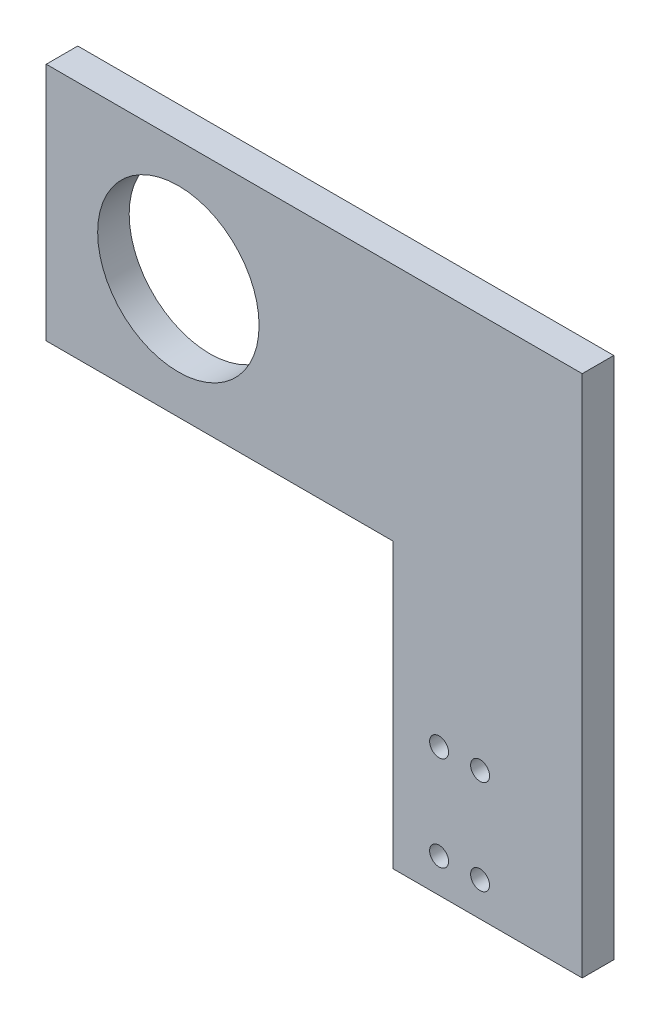
ISO-10303-21;
HEADER;
FILE_DESCRIPTION(('STEP AP214'),'2;1');
FILE_NAME('part.step','',(''),(''),'','','');
FILE_SCHEMA(('AUTOMOTIVE_DESIGN { 1 0 10303 214 1 1 1 1 }'));
ENDSEC;
DATA;
#1=APPLICATION_CONTEXT('core data for automotive mechanical design processes');
#2=APPLICATION_PROTOCOL_DEFINITION('international standard','automotive_design',2000,#1);
#3=PRODUCT_CONTEXT('',#1,'mechanical');
#4=PRODUCT('Part','Part','',(#3));
#5=PRODUCT_RELATED_PRODUCT_CATEGORY('part','',(#4));
#6=PRODUCT_DEFINITION_FORMATION('','',#4);
#7=PRODUCT_DEFINITION_CONTEXT('part definition',#1,'design');
#8=PRODUCT_DEFINITION('design','',#6,#7);
#9=PRODUCT_DEFINITION_SHAPE('','',#8);
#10=(LENGTH_UNIT() NAMED_UNIT(*) SI_UNIT(.MILLI.,.METRE.));
#11=(NAMED_UNIT(*) PLANE_ANGLE_UNIT() SI_UNIT($,.RADIAN.));
#12=(NAMED_UNIT(*) SI_UNIT($,.STERADIAN.) SOLID_ANGLE_UNIT());
#13=UNCERTAINTY_MEASURE_WITH_UNIT(LENGTH_MEASURE(1.E-05),#10,'distance_accuracy_value','');
#14=(GEOMETRIC_REPRESENTATION_CONTEXT(3) GLOBAL_UNCERTAINTY_ASSIGNED_CONTEXT((#13)) GLOBAL_UNIT_ASSIGNED_CONTEXT((#10,
#11,#12)) REPRESENTATION_CONTEXT('',''));
#15=CARTESIAN_POINT('',(0.,0.,0.));
#16=DIRECTION('',(0.,0.,1.));
#17=DIRECTION('',(1.,0.,0.));
#18=AXIS2_PLACEMENT_3D('',#15,#16,#17);
#19=CARTESIAN_POINT('',(0.,0.,5.));
#20=DIRECTION('',(0.,0.,-1.));
#21=DIRECTION('',(-1.,0.,0.));
#22=AXIS2_PLACEMENT_3D('',#19,#20,#21);
#23=PLANE('',#22);
#24=DIRECTION('',(1.,0.,0.));
#25=VECTOR('',#24,1.);
#26=CARTESIAN_POINT('',(2402.48052922548,4706.10720774091,5.));
#27=LINE('',#26,#25);
#28=CARTESIAN_POINT('',(2347.48052922548,4706.10720774091,5.));
#29=VERTEX_POINT('',#28);
#30=CARTESIAN_POINT('',(2402.48052922548,4706.10720774091,5.));
#31=VERTEX_POINT('',#30);
#32=EDGE_CURVE('E131',#29,#31,#27,.T.);
#33=ORIENTED_EDGE('',*,*,#32,.T.);
#34=DIRECTION('',(0.,-1.,0.));
#35=VECTOR('',#34,1.);
#36=CARTESIAN_POINT('',(2402.48052922548,4706.10720774091,5.));
#37=LINE('',#36,#35);
#38=CARTESIAN_POINT('',(2402.48052922548,4661.10720774091,5.));
#39=VERTEX_POINT('',#38);
#40=EDGE_CURVE('E89',#31,#39,#37,.T.);
#41=ORIENTED_EDGE('',*,*,#40,.T.);
#42=DIRECTION('',(1.,0.,0.));
#43=VECTOR('',#42,1.);
#44=CARTESIAN_POINT('',(2402.48052922548,4661.10720774091,5.));
#45=LINE('',#44,#43);
#46=CARTESIAN_POINT('',(2432.48052922548,4661.10720774091,5.));
#47=VERTEX_POINT('',#46);
#48=EDGE_CURVE('E102',#39,#47,#45,.T.);
#49=ORIENTED_EDGE('',*,*,#48,.T.);
#50=DIRECTION('',(0.,1.,0.));
#51=VECTOR('',#50,1.);
#52=CARTESIAN_POINT('',(2432.48052922548,4661.10720774091,5.));
#53=LINE('',#52,#51);
#54=CARTESIAN_POINT('',(2432.48052922548,4744.10720774091,5.));
#55=VERTEX_POINT('',#54);
#56=EDGE_CURVE('E96',#47,#55,#53,.T.);
#57=ORIENTED_EDGE('',*,*,#56,.T.);
#58=DIRECTION('',(-1.,0.,0.));
#59=VECTOR('',#58,1.);
#60=CARTESIAN_POINT('',(2432.48052922548,4744.10720774091,5.));
#61=LINE('',#60,#59);
#62=CARTESIAN_POINT('',(2347.48052922548,4744.10720774091,5.));
#63=VERTEX_POINT('',#62);
#64=EDGE_CURVE('E100',#55,#63,#61,.T.);
#65=ORIENTED_EDGE('',*,*,#64,.T.);
#66=DIRECTION('',(0.,-1.,0.));
#67=VECTOR('',#66,1.);
#68=CARTESIAN_POINT('',(2347.48052922548,4706.10720774091,5.));
#69=LINE('',#68,#67);
#70=EDGE_CURVE('E52',#63,#29,#69,.T.);
#71=ORIENTED_EDGE('',*,*,#70,.T.);
#72=EDGE_LOOP('',(#33,#41,#49,#57,#65,#71));
#73=FACE_BOUND('',#72,.T.);
#74=CARTESIAN_POINT('',(2409.77934742913,4666.50720774091,5.));
#75=DIRECTION('',(0.,0.,1.));
#76=DIRECTION('',(1.,0.,0.));
#77=AXIS2_PLACEMENT_3D('',#74,#75,#76);
#78=CIRCLE('',#77,1.50000000000006);
#79=CARTESIAN_POINT('',(2411.27934742913,4666.50720774091,5.));
#80=VERTEX_POINT('',#79);
#81=EDGE_CURVE('E124',#80,#80,#78,.T.);
#82=ORIENTED_EDGE('',*,*,#81,.F.);
#83=EDGE_LOOP('',(#82));
#84=FACE_BOUND('',#83,.T.);
#85=CARTESIAN_POINT('',(2409.77934742913,4681.50720774091,5.));
#86=DIRECTION('',(0.,0.,1.));
#87=DIRECTION('',(1.,0.,0.));
#88=AXIS2_PLACEMENT_3D('',#85,#86,#87);
#89=CIRCLE('',#88,1.50000000000006);
#90=CARTESIAN_POINT('',(2411.27934742913,4681.50720774091,5.));
#91=VERTEX_POINT('',#90);
#92=EDGE_CURVE('E205',#91,#91,#89,.T.);
#93=ORIENTED_EDGE('',*,*,#92,.F.);
#94=EDGE_LOOP('',(#93));
#95=FACE_BOUND('',#94,.T.);
#96=CARTESIAN_POINT('',(2416.27934742913,4666.50720774091,5.));
#97=DIRECTION('',(0.,0.,1.));
#98=DIRECTION('',(1.,0.,0.));
#99=AXIS2_PLACEMENT_3D('',#96,#97,#98);
#100=CIRCLE('',#99,1.50000000000006);
#101=CARTESIAN_POINT('',(2417.77934742913,4666.50720774091,5.));
#102=VERTEX_POINT('',#101);
#103=EDGE_CURVE('E199',#102,#102,#100,.T.);
#104=ORIENTED_EDGE('',*,*,#103,.F.);
#105=EDGE_LOOP('',(#104));
#106=FACE_BOUND('',#105,.T.);
#107=CARTESIAN_POINT('',(2416.27934742913,4681.50720774091,5.));
#108=DIRECTION('',(0.,0.,1.));
#109=DIRECTION('',(1.,0.,0.));
#110=AXIS2_PLACEMENT_3D('',#107,#108,#109);
#111=CIRCLE('',#110,1.50000000000006);
#112=CARTESIAN_POINT('',(2417.77934742913,4681.50720774091,5.));
#113=VERTEX_POINT('',#112);
#114=EDGE_CURVE('E193',#113,#113,#111,.T.);
#115=ORIENTED_EDGE('',*,*,#114,.F.);
#116=EDGE_LOOP('',(#115));
#117=FACE_BOUND('',#116,.T.);
#118=CARTESIAN_POINT('',(2368.43350916696,4725.10720774091,5.));
#119=DIRECTION('',(0.,0.,1.));
#120=DIRECTION('',(1.,0.,0.));
#121=AXIS2_PLACEMENT_3D('',#118,#119,#120);
#122=CIRCLE('',#121,12.7999999999999);
#123=CARTESIAN_POINT('',(2381.23350916696,4725.10720774091,5.));
#124=VERTEX_POINT('',#123);
#125=EDGE_CURVE('E184',#124,#124,#122,.T.);
#126=ORIENTED_EDGE('',*,*,#125,.F.);
#127=EDGE_LOOP('',(#126));
#128=FACE_BOUND('',#127,.T.);
#129=ADVANCED_FACE('F35',(#73,#84,#95,#106,#117,#128),#23,.F.);
#130=CARTESIAN_POINT('',(0.,0.,0.));
#131=DIRECTION('',(0.,0.,-1.));
#132=DIRECTION('',(-1.,0.,0.));
#133=AXIS2_PLACEMENT_3D('',#130,#131,#132);
#134=PLANE('',#133);
#135=CARTESIAN_POINT('',(2416.27934742913,4681.50720774091,0.));
#136=DIRECTION('',(0.,0.,1.));
#137=DIRECTION('',(1.,0.,0.));
#138=AXIS2_PLACEMENT_3D('',#135,#136,#137);
#139=CIRCLE('',#138,1.50000000000006);
#140=CARTESIAN_POINT('',(2417.77934742913,4681.50720774091,0.));
#141=VERTEX_POINT('',#140);
#142=EDGE_CURVE('E190',#141,#141,#139,.T.);
#143=ORIENTED_EDGE('',*,*,#142,.T.);
#144=EDGE_LOOP('',(#143));
#145=FACE_BOUND('',#144,.T.);
#146=CARTESIAN_POINT('',(2409.77934742913,4681.50720774091,0.));
#147=DIRECTION('',(0.,0.,1.));
#148=DIRECTION('',(1.,0.,0.));
#149=AXIS2_PLACEMENT_3D('',#146,#147,#148);
#150=CIRCLE('',#149,1.50000000000006);
#151=CARTESIAN_POINT('',(2411.27934742913,4681.50720774091,0.));
#152=VERTEX_POINT('',#151);
#153=EDGE_CURVE('E202',#152,#152,#150,.T.);
#154=ORIENTED_EDGE('',*,*,#153,.T.);
#155=EDGE_LOOP('',(#154));
#156=FACE_BOUND('',#155,.T.);
#157=DIRECTION('',(1.,0.,0.));
#158=VECTOR('',#157,1.);
#159=CARTESIAN_POINT('',(2402.48052922548,4706.10720774091,0.));
#160=LINE('',#159,#158);
#161=CARTESIAN_POINT('',(2347.48052922548,4706.10720774091,0.));
#162=VERTEX_POINT('',#161);
#163=CARTESIAN_POINT('',(2402.48052922548,4706.10720774091,0.));
#164=VERTEX_POINT('',#163);
#165=EDGE_CURVE('E120',#162,#164,#160,.T.);
#166=ORIENTED_EDGE('',*,*,#165,.F.);
#167=DIRECTION('',(0.,-1.,0.));
#168=VECTOR('',#167,1.);
#169=CARTESIAN_POINT('',(2347.48052922548,4706.10720774091,0.));
#170=LINE('',#169,#168);
#171=CARTESIAN_POINT('',(2347.48052922548,4744.10720774091,0.));
#172=VERTEX_POINT('',#171);
#173=EDGE_CURVE('E81',#172,#162,#170,.T.);
#174=ORIENTED_EDGE('',*,*,#173,.F.);
#175=DIRECTION('',(-1.,0.,0.));
#176=VECTOR('',#175,1.);
#177=CARTESIAN_POINT('',(2432.48052922548,4744.10720774091,0.));
#178=LINE('',#177,#176);
#179=CARTESIAN_POINT('',(2432.48052922548,4744.10720774091,0.));
#180=VERTEX_POINT('',#179);
#181=EDGE_CURVE('E75',#180,#172,#178,.T.);
#182=ORIENTED_EDGE('',*,*,#181,.F.);
#183=DIRECTION('',(0.,1.,0.));
#184=VECTOR('',#183,1.);
#185=CARTESIAN_POINT('',(2432.48052922548,4661.10720774091,0.));
#186=LINE('',#185,#184);
#187=CARTESIAN_POINT('',(2432.48052922548,4661.10720774091,0.));
#188=VERTEX_POINT('',#187);
#189=EDGE_CURVE('E110',#188,#180,#186,.T.);
#190=ORIENTED_EDGE('',*,*,#189,.F.);
#191=DIRECTION('',(1.,0.,0.));
#192=VECTOR('',#191,1.);
#193=CARTESIAN_POINT('',(2402.48052922548,4661.10720774091,0.));
#194=LINE('',#193,#192);
#195=CARTESIAN_POINT('',(2402.48052922548,4661.10720774091,0.));
#196=VERTEX_POINT('',#195);
#197=EDGE_CURVE('E126',#196,#188,#194,.T.);
#198=ORIENTED_EDGE('',*,*,#197,.F.);
#199=DIRECTION('',(0.,-1.,0.));
#200=VECTOR('',#199,1.);
#201=CARTESIAN_POINT('',(2402.48052922548,4706.10720774091,0.));
#202=LINE('',#201,#200);
#203=EDGE_CURVE('E123',#164,#196,#202,.T.);
#204=ORIENTED_EDGE('',*,*,#203,.F.);
#205=EDGE_LOOP('',(#166,#174,#182,#190,#198,#204));
#206=FACE_BOUND('',#205,.T.);
#207=CARTESIAN_POINT('',(2409.77934742913,4666.50720774091,0.));
#208=DIRECTION('',(0.,0.,1.));
#209=DIRECTION('',(1.,0.,0.));
#210=AXIS2_PLACEMENT_3D('',#207,#208,#209);
#211=CIRCLE('',#210,1.50000000000006);
#212=CARTESIAN_POINT('',(2411.27934742913,4666.50720774091,0.));
#213=VERTEX_POINT('',#212);
#214=EDGE_CURVE('E208',#213,#213,#211,.T.);
#215=ORIENTED_EDGE('',*,*,#214,.T.);
#216=EDGE_LOOP('',(#215));
#217=FACE_BOUND('',#216,.T.);
#218=CARTESIAN_POINT('',(2416.27934742913,4666.50720774091,0.));
#219=DIRECTION('',(0.,0.,1.));
#220=DIRECTION('',(1.,0.,0.));
#221=AXIS2_PLACEMENT_3D('',#218,#219,#220);
#222=CIRCLE('',#221,1.50000000000006);
#223=CARTESIAN_POINT('',(2417.77934742913,4666.50720774091,0.));
#224=VERTEX_POINT('',#223);
#225=EDGE_CURVE('E196',#224,#224,#222,.T.);
#226=ORIENTED_EDGE('',*,*,#225,.T.);
#227=EDGE_LOOP('',(#226));
#228=FACE_BOUND('',#227,.T.);
#229=CARTESIAN_POINT('',(2368.43350916696,4725.10720774091,0.));
#230=DIRECTION('',(0.,0.,1.));
#231=DIRECTION('',(1.,0.,0.));
#232=AXIS2_PLACEMENT_3D('',#229,#230,#231);
#233=CIRCLE('',#232,12.7999999999999);
#234=CARTESIAN_POINT('',(2381.23350916696,4725.10720774091,0.));
#235=VERTEX_POINT('',#234);
#236=EDGE_CURVE('E187',#235,#235,#233,.T.);
#237=ORIENTED_EDGE('',*,*,#236,.T.);
#238=EDGE_LOOP('',(#237));
#239=FACE_BOUND('',#238,.T.);
#240=ADVANCED_FACE('F140',(#145,#156,#206,#217,#228,#239),#134,.T.);
#241=CARTESIAN_POINT('',(2402.48052922548,4706.10720774091,5.));
#242=DIRECTION('',(0.,1.,0.));
#243=DIRECTION('',(0.,0.,1.));
#244=AXIS2_PLACEMENT_3D('',#241,#242,#243);
#245=PLANE('',#244);
#246=ORIENTED_EDGE('',*,*,#165,.T.);
#247=DIRECTION('',(0.,0.,-1.));
#248=VECTOR('',#247,1.);
#249=CARTESIAN_POINT('',(2402.48052922548,4706.10720774091,5.));
#250=LINE('',#249,#248);
#251=EDGE_CURVE('E11',#31,#164,#250,.T.);
#252=ORIENTED_EDGE('',*,*,#251,.F.);
#253=ORIENTED_EDGE('',*,*,#32,.F.);
#254=DIRECTION('',(0.,0.,-1.));
#255=VECTOR('',#254,1.);
#256=CARTESIAN_POINT('',(2347.48052922548,4706.10720774091,5.));
#257=LINE('',#256,#255);
#258=EDGE_CURVE('E116',#29,#162,#257,.T.);
#259=ORIENTED_EDGE('',*,*,#258,.T.);
#260=EDGE_LOOP('',(#246,#252,#253,#259));
#261=FACE_BOUND('',#260,.T.);
#262=ADVANCED_FACE('F37',(#261),#245,.F.);
#263=CARTESIAN_POINT('',(2402.48052922548,4706.10720774091,5.));
#264=DIRECTION('',(1.,0.,0.));
#265=DIRECTION('',(0.,0.,-1.));
#266=AXIS2_PLACEMENT_3D('',#263,#264,#265);
#267=PLANE('',#266);
#268=ORIENTED_EDGE('',*,*,#203,.T.);
#269=DIRECTION('',(0.,0.,-1.));
#270=VECTOR('',#269,1.);
#271=CARTESIAN_POINT('',(2402.48052922548,4661.10720774091,5.));
#272=LINE('',#271,#270);
#273=EDGE_CURVE('E44',#39,#196,#272,.T.);
#274=ORIENTED_EDGE('',*,*,#273,.F.);
#275=ORIENTED_EDGE('',*,*,#40,.F.);
#276=ORIENTED_EDGE('',*,*,#251,.T.);
#277=EDGE_LOOP('',(#268,#274,#275,#276));
#278=FACE_BOUND('',#277,.T.);
#279=ADVANCED_FACE('F277',(#278),#267,.F.);
#280=CARTESIAN_POINT('',(2402.48052922548,4661.10720774091,5.));
#281=DIRECTION('',(0.,1.,0.));
#282=DIRECTION('',(0.,0.,1.));
#283=AXIS2_PLACEMENT_3D('',#280,#281,#282);
#284=PLANE('',#283);
#285=ORIENTED_EDGE('',*,*,#197,.T.);
#286=DIRECTION('',(0.,0.,-1.));
#287=VECTOR('',#286,1.);
#288=CARTESIAN_POINT('',(2432.48052922548,4661.10720774091,5.));
#289=LINE('',#288,#287);
#290=EDGE_CURVE('E111',#47,#188,#289,.T.);
#291=ORIENTED_EDGE('',*,*,#290,.F.);
#292=ORIENTED_EDGE('',*,*,#48,.F.);
#293=ORIENTED_EDGE('',*,*,#273,.T.);
#294=EDGE_LOOP('',(#285,#291,#292,#293));
#295=FACE_BOUND('',#294,.T.);
#296=ADVANCED_FACE('F137',(#295),#284,.F.);
#297=CARTESIAN_POINT('',(2432.48052922548,4661.10720774091,5.));
#298=DIRECTION('',(-1.,0.,0.));
#299=DIRECTION('',(0.,0.,1.));
#300=AXIS2_PLACEMENT_3D('',#297,#298,#299);
#301=PLANE('',#300);
#302=ORIENTED_EDGE('',*,*,#189,.T.);
#303=DIRECTION('',(0.,0.,-1.));
#304=VECTOR('',#303,1.);
#305=CARTESIAN_POINT('',(2432.48052922548,4744.10720774091,5.));
#306=LINE('',#305,#304);
#307=EDGE_CURVE('E107',#55,#180,#306,.T.);
#308=ORIENTED_EDGE('',*,*,#307,.F.);
#309=ORIENTED_EDGE('',*,*,#56,.F.);
#310=ORIENTED_EDGE('',*,*,#290,.T.);
#311=EDGE_LOOP('',(#302,#308,#309,#310));
#312=FACE_BOUND('',#311,.T.);
#313=ADVANCED_FACE('F108',(#312),#301,.F.);
#314=CARTESIAN_POINT('',(2432.48052922548,4744.10720774091,5.));
#315=DIRECTION('',(0.,-1.,0.));
#316=DIRECTION('',(0.,0.,-1.));
#317=AXIS2_PLACEMENT_3D('',#314,#315,#316);
#318=PLANE('',#317);
#319=ORIENTED_EDGE('',*,*,#181,.T.);
#320=DIRECTION('',(0.,0.,-1.));
#321=VECTOR('',#320,1.);
#322=CARTESIAN_POINT('',(2347.48052922548,4744.10720774091,5.));
#323=LINE('',#322,#321);
#324=EDGE_CURVE('E112',#63,#172,#323,.T.);
#325=ORIENTED_EDGE('',*,*,#324,.F.);
#326=ORIENTED_EDGE('',*,*,#64,.F.);
#327=ORIENTED_EDGE('',*,*,#307,.T.);
#328=EDGE_LOOP('',(#319,#325,#326,#327));
#329=FACE_BOUND('',#328,.T.);
#330=ADVANCED_FACE('F114',(#329),#318,.F.);
#331=CARTESIAN_POINT('',(2347.48052922548,4706.10720774091,5.));
#332=DIRECTION('',(1.,0.,0.));
#333=DIRECTION('',(0.,0.,-1.));
#334=AXIS2_PLACEMENT_3D('',#331,#332,#333);
#335=PLANE('',#334);
#336=ORIENTED_EDGE('',*,*,#173,.T.);
#337=ORIENTED_EDGE('',*,*,#258,.F.);
#338=ORIENTED_EDGE('',*,*,#70,.F.);
#339=ORIENTED_EDGE('',*,*,#324,.T.);
#340=EDGE_LOOP('',(#336,#337,#338,#339));
#341=FACE_BOUND('',#340,.T.);
#342=ADVANCED_FACE('F145',(#341),#335,.F.);
#343=CARTESIAN_POINT('',(2409.77934742913,4666.50720774091,5.));
#344=DIRECTION('',(0.,0.,-1.));
#345=DIRECTION('',(-1.,0.,0.));
#346=AXIS2_PLACEMENT_3D('',#343,#344,#345);
#347=CYLINDRICAL_SURFACE('',#346,1.50000000000006);
#348=ORIENTED_EDGE('',*,*,#81,.T.);
#349=EDGE_LOOP('',(#348));
#350=FACE_BOUND('',#349,.T.);
#351=ORIENTED_EDGE('',*,*,#214,.F.);
#352=EDGE_LOOP('',(#351));
#353=FACE_BOUND('',#352,.T.);
#354=ADVANCED_FACE('F147',(#350,#353),#347,.F.);
#355=CARTESIAN_POINT('',(2409.77934742913,4681.50720774091,5.));
#356=DIRECTION('',(0.,0.,-1.));
#357=DIRECTION('',(-1.,0.,0.));
#358=AXIS2_PLACEMENT_3D('',#355,#356,#357);
#359=CYLINDRICAL_SURFACE('',#358,1.50000000000006);
#360=ORIENTED_EDGE('',*,*,#92,.T.);
#361=EDGE_LOOP('',(#360));
#362=FACE_BOUND('',#361,.T.);
#363=ORIENTED_EDGE('',*,*,#153,.F.);
#364=EDGE_LOOP('',(#363));
#365=FACE_BOUND('',#364,.T.);
#366=ADVANCED_FACE('F153',(#362,#365),#359,.F.);
#367=CARTESIAN_POINT('',(2416.27934742913,4666.50720774091,5.));
#368=DIRECTION('',(0.,0.,-1.));
#369=DIRECTION('',(-1.,0.,0.));
#370=AXIS2_PLACEMENT_3D('',#367,#368,#369);
#371=CYLINDRICAL_SURFACE('',#370,1.50000000000006);
#372=ORIENTED_EDGE('',*,*,#103,.T.);
#373=EDGE_LOOP('',(#372));
#374=FACE_BOUND('',#373,.T.);
#375=ORIENTED_EDGE('',*,*,#225,.F.);
#376=EDGE_LOOP('',(#375));
#377=FACE_BOUND('',#376,.T.);
#378=ADVANCED_FACE('F167',(#374,#377),#371,.F.);
#379=CARTESIAN_POINT('',(2416.27934742913,4681.50720774091,5.));
#380=DIRECTION('',(0.,0.,-1.));
#381=DIRECTION('',(-1.,0.,0.));
#382=AXIS2_PLACEMENT_3D('',#379,#380,#381);
#383=CYLINDRICAL_SURFACE('',#382,1.50000000000006);
#384=ORIENTED_EDGE('',*,*,#114,.T.);
#385=EDGE_LOOP('',(#384));
#386=FACE_BOUND('',#385,.T.);
#387=ORIENTED_EDGE('',*,*,#142,.F.);
#388=EDGE_LOOP('',(#387));
#389=FACE_BOUND('',#388,.T.);
#390=ADVANCED_FACE('F171',(#386,#389),#383,.F.);
#391=CARTESIAN_POINT('',(2368.43350916696,4725.10720774091,5.));
#392=DIRECTION('',(0.,0.,-1.));
#393=DIRECTION('',(-1.,0.,0.));
#394=AXIS2_PLACEMENT_3D('',#391,#392,#393);
#395=CYLINDRICAL_SURFACE('',#394,12.7999999999999);
#396=ORIENTED_EDGE('',*,*,#125,.T.);
#397=EDGE_LOOP('',(#396));
#398=FACE_BOUND('',#397,.T.);
#399=ORIENTED_EDGE('',*,*,#236,.F.);
#400=EDGE_LOOP('',(#399));
#401=FACE_BOUND('',#400,.T.);
#402=ADVANCED_FACE('F175',(#398,#401),#395,.F.);
#403=CLOSED_SHELL('',(#129,#240,#262,#279,#296,#313,#330,#342,#354,#366,#378,#390,#402));
#404=MANIFOLD_SOLID_BREP('B2',#403);
#405=ADVANCED_BREP_SHAPE_REPRESENTATION('',(#18,#404),#14);
#406=SHAPE_DEFINITION_REPRESENTATION(#9,#405);
ENDSEC;
END-ISO-10303-21;
